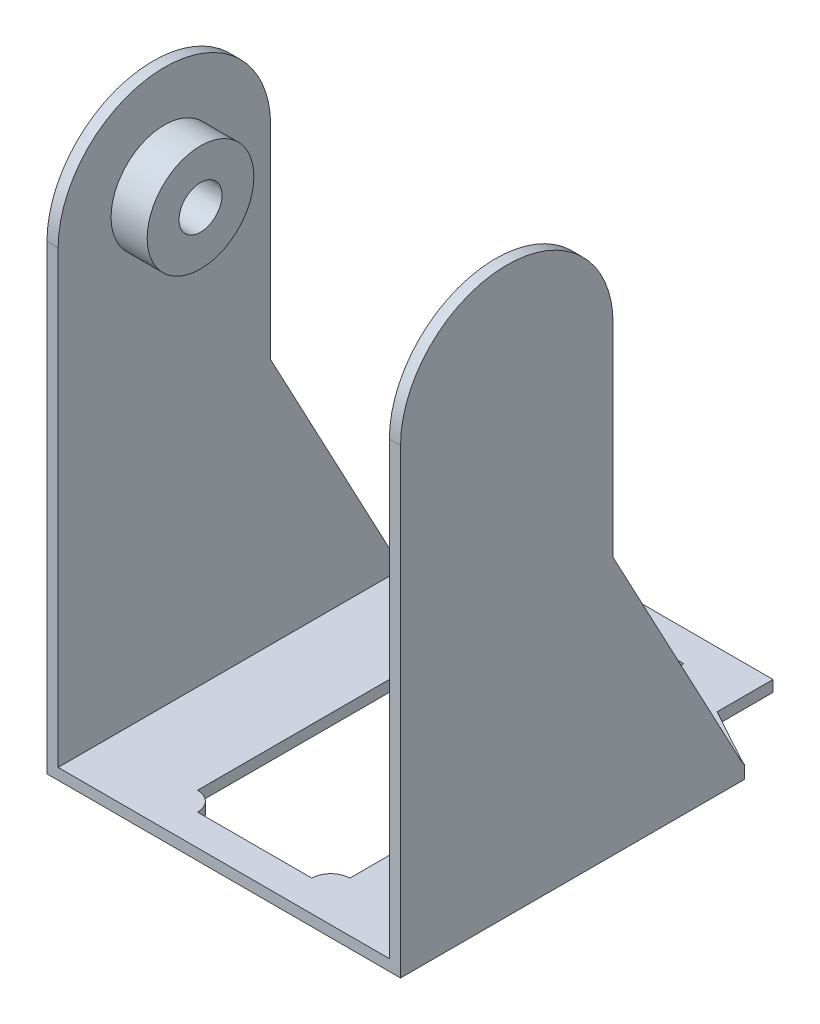
ISO-10303-21;
HEADER;
FILE_DESCRIPTION(('STEP AP214'),'2;1');
FILE_NAME('part.step','',(''),(''),'','','');
FILE_SCHEMA(('AUTOMOTIVE_DESIGN { 1 0 10303 214 1 1 1 1 }'));
ENDSEC;
DATA;
#1=APPLICATION_CONTEXT('core data for automotive mechanical design processes');
#2=APPLICATION_PROTOCOL_DEFINITION('international standard','automotive_design',2000,#1);
#3=PRODUCT_CONTEXT('',#1,'mechanical');
#4=PRODUCT('Part','Part','',(#3));
#5=PRODUCT_RELATED_PRODUCT_CATEGORY('part','',(#4));
#6=PRODUCT_DEFINITION_FORMATION('','',#4);
#7=PRODUCT_DEFINITION_CONTEXT('part definition',#1,'design');
#8=PRODUCT_DEFINITION('design','',#6,#7);
#9=PRODUCT_DEFINITION_SHAPE('','',#8);
#10=(LENGTH_UNIT() NAMED_UNIT(*) SI_UNIT(.MILLI.,.METRE.));
#11=(NAMED_UNIT(*) PLANE_ANGLE_UNIT() SI_UNIT($,.RADIAN.));
#12=(NAMED_UNIT(*) SI_UNIT($,.STERADIAN.) SOLID_ANGLE_UNIT());
#13=UNCERTAINTY_MEASURE_WITH_UNIT(LENGTH_MEASURE(1.E-05),#10,'distance_accuracy_value','');
#14=(GEOMETRIC_REPRESENTATION_CONTEXT(3) GLOBAL_UNCERTAINTY_ASSIGNED_CONTEXT((#13)) GLOBAL_UNIT_ASSIGNED_CONTEXT((#10,
#11,#12)) REPRESENTATION_CONTEXT('',''));
#15=CARTESIAN_POINT('',(0.,0.,0.));
#16=DIRECTION('',(0.,0.,1.));
#17=DIRECTION('',(1.,0.,0.));
#18=AXIS2_PLACEMENT_3D('',#15,#16,#17);
#19=CARTESIAN_POINT('',(0.,1.3,16.4));
#20=DIRECTION('',(0.,0.,-1.));
#21=DIRECTION('',(-1.,0.,0.));
#22=AXIS2_PLACEMENT_3D('',#19,#20,#21);
#23=PLANE('',#22);
#24=DIRECTION('',(1.,0.,0.));
#25=VECTOR('',#24,1.);
#26=CARTESIAN_POINT('',(0.,0.,16.4));
#27=LINE('',#26,#25);
#28=CARTESIAN_POINT('',(-6.65,0.,16.4));
#29=VERTEX_POINT('',#28);
#30=CARTESIAN_POINT('',(6.65000000000002,0.,16.4));
#31=VERTEX_POINT('',#30);
#32=EDGE_CURVE('E422',#29,#31,#27,.T.);
#33=ORIENTED_EDGE('',*,*,#32,.F.);
#34=DIRECTION('',(0.,-1.,0.));
#35=VECTOR('',#34,1.);
#36=CARTESIAN_POINT('',(-6.65,1.3,16.4));
#37=LINE('',#36,#35);
#38=CARTESIAN_POINT('',(-6.65,1.3,16.4));
#39=VERTEX_POINT('',#38);
#40=EDGE_CURVE('E474',#39,#29,#37,.T.);
#41=ORIENTED_EDGE('',*,*,#40,.F.);
#42=DIRECTION('',(1.,0.,0.));
#43=VECTOR('',#42,1.);
#44=CARTESIAN_POINT('',(0.,1.3,16.4));
#45=LINE('',#44,#43);
#46=CARTESIAN_POINT('',(6.65000000000002,1.3,16.4));
#47=VERTEX_POINT('',#46);
#48=EDGE_CURVE('E364',#39,#47,#45,.T.);
#49=ORIENTED_EDGE('',*,*,#48,.T.);
#50=DIRECTION('',(0.,-1.,0.));
#51=VECTOR('',#50,1.);
#52=CARTESIAN_POINT('',(6.65000000000002,1.3,16.4));
#53=LINE('',#52,#51);
#54=EDGE_CURVE('E453',#47,#31,#53,.T.);
#55=ORIENTED_EDGE('',*,*,#54,.T.);
#56=EDGE_LOOP('',(#33,#41,#49,#55));
#57=FACE_BOUND('',#56,.T.);
#58=ADVANCED_FACE('F45',(#57),#23,.T.);
#59=CARTESIAN_POINT('',(-8.85,1.3,16.4));
#60=DIRECTION('',(0.,-1.,0.));
#61=DIRECTION('',(0.,0.,-1.));
#62=AXIS2_PLACEMENT_3D('',#59,#60,#61);
#63=CYLINDRICAL_SURFACE('',#62,2.2);
#64=CARTESIAN_POINT('',(-8.85,0.,16.4));
#65=DIRECTION('',(0.,1.,0.));
#66=DIRECTION('',(0.,0.,1.));
#67=AXIS2_PLACEMENT_3D('',#64,#65,#66);
#68=CIRCLE('',#67,2.2);
#69=CARTESIAN_POINT('',(-8.85,0.,14.2));
#70=VERTEX_POINT('',#69);
#71=EDGE_CURVE('E426',#29,#70,#68,.T.);
#72=ORIENTED_EDGE('',*,*,#71,.T.);
#73=DIRECTION('',(0.,-1.,0.));
#74=VECTOR('',#73,1.);
#75=CARTESIAN_POINT('',(-8.85,1.3,14.2));
#76=LINE('',#75,#74);
#77=CARTESIAN_POINT('',(-8.85,1.3,14.2));
#78=VERTEX_POINT('',#77);
#79=EDGE_CURVE('E471',#78,#70,#76,.T.);
#80=ORIENTED_EDGE('',*,*,#79,.F.);
#81=CARTESIAN_POINT('',(-8.85,1.3,16.4));
#82=DIRECTION('',(0.,1.,0.));
#83=DIRECTION('',(0.,0.,1.));
#84=AXIS2_PLACEMENT_3D('',#81,#82,#83);
#85=CIRCLE('',#84,2.2);
#86=EDGE_CURVE('E368',#39,#78,#85,.T.);
#87=ORIENTED_EDGE('',*,*,#86,.F.);
#88=ORIENTED_EDGE('',*,*,#40,.T.);
#89=EDGE_LOOP('',(#72,#80,#87,#88));
#90=FACE_BOUND('',#89,.T.);
#91=ADVANCED_FACE('F561',(#90),#63,.T.);
#92=CARTESIAN_POINT('',(-8.85,1.3,0.));
#93=DIRECTION('',(1.,0.,0.));
#94=DIRECTION('',(0.,0.,-1.));
#95=AXIS2_PLACEMENT_3D('',#92,#93,#94);
#96=PLANE('',#95);
#97=DIRECTION('',(0.,0.,1.));
#98=VECTOR('',#97,1.);
#99=CARTESIAN_POINT('',(-8.85,0.,0.));
#100=LINE('',#99,#98);
#101=CARTESIAN_POINT('',(-8.85,0.,-24.6));
#102=VERTEX_POINT('',#101);
#103=EDGE_CURVE('E430',#102,#70,#100,.T.);
#104=ORIENTED_EDGE('',*,*,#103,.F.);
#105=DIRECTION('',(0.,-1.,0.));
#106=VECTOR('',#105,1.);
#107=CARTESIAN_POINT('',(-8.85,1.3,-24.6));
#108=LINE('',#107,#106);
#109=CARTESIAN_POINT('',(-8.85,1.3,-24.6));
#110=VERTEX_POINT('',#109);
#111=EDGE_CURVE('E468',#110,#102,#108,.T.);
#112=ORIENTED_EDGE('',*,*,#111,.F.);
#113=DIRECTION('',(0.,0.,1.));
#114=VECTOR('',#113,1.);
#115=CARTESIAN_POINT('',(-8.85,1.3,0.));
#116=LINE('',#115,#114);
#117=EDGE_CURVE('E371',#110,#78,#116,.T.);
#118=ORIENTED_EDGE('',*,*,#117,.T.);
#119=ORIENTED_EDGE('',*,*,#79,.T.);
#120=EDGE_LOOP('',(#104,#112,#118,#119));
#121=FACE_BOUND('',#120,.T.);
#122=ADVANCED_FACE('F567',(#121),#96,.T.);
#123=CARTESIAN_POINT('',(-8.85,1.3,-26.8));
#124=DIRECTION('',(0.,-1.,0.));
#125=DIRECTION('',(0.,0.,-1.));
#126=AXIS2_PLACEMENT_3D('',#123,#124,#125);
#127=CYLINDRICAL_SURFACE('',#126,2.2);
#128=CARTESIAN_POINT('',(-8.85,0.,-26.8));
#129=DIRECTION('',(0.,1.,0.));
#130=DIRECTION('',(0.,0.,1.));
#131=AXIS2_PLACEMENT_3D('',#128,#129,#130);
#132=CIRCLE('',#131,2.2);
#133=CARTESIAN_POINT('',(-6.65,0.,-26.8));
#134=VERTEX_POINT('',#133);
#135=EDGE_CURVE('E434',#102,#134,#132,.T.);
#136=ORIENTED_EDGE('',*,*,#135,.T.);
#137=DIRECTION('',(0.,-1.,0.));
#138=VECTOR('',#137,1.);
#139=CARTESIAN_POINT('',(-6.65,1.3,-26.8));
#140=LINE('',#139,#138);
#141=CARTESIAN_POINT('',(-6.65,1.3,-26.8));
#142=VERTEX_POINT('',#141);
#143=EDGE_CURVE('E465',#142,#134,#140,.T.);
#144=ORIENTED_EDGE('',*,*,#143,.F.);
#145=CARTESIAN_POINT('',(-8.85,1.3,-26.8));
#146=DIRECTION('',(0.,1.,0.));
#147=DIRECTION('',(0.,0.,1.));
#148=AXIS2_PLACEMENT_3D('',#145,#146,#147);
#149=CIRCLE('',#148,2.2);
#150=EDGE_CURVE('E375',#110,#142,#149,.T.);
#151=ORIENTED_EDGE('',*,*,#150,.F.);
#152=ORIENTED_EDGE('',*,*,#111,.T.);
#153=EDGE_LOOP('',(#136,#144,#151,#152));
#154=FACE_BOUND('',#153,.T.);
#155=ADVANCED_FACE('F1002',(#154),#127,.T.);
#156=CARTESIAN_POINT('',(0.,1.3,-26.8));
#157=DIRECTION('',(0.,0.,1.));
#158=DIRECTION('',(1.,0.,0.));
#159=AXIS2_PLACEMENT_3D('',#156,#157,#158);
#160=PLANE('',#159);
#161=DIRECTION('',(-1.,0.,0.));
#162=VECTOR('',#161,1.);
#163=CARTESIAN_POINT('',(0.,0.,-26.8));
#164=LINE('',#163,#162);
#165=CARTESIAN_POINT('',(6.65,0.,-26.8));
#166=VERTEX_POINT('',#165);
#167=EDGE_CURVE('E438',#166,#134,#164,.T.);
#168=ORIENTED_EDGE('',*,*,#167,.F.);
#169=DIRECTION('',(0.,-1.,0.));
#170=VECTOR('',#169,1.);
#171=CARTESIAN_POINT('',(6.65,1.3,-26.8));
#172=LINE('',#171,#170);
#173=CARTESIAN_POINT('',(6.65,1.3,-26.8));
#174=VERTEX_POINT('',#173);
#175=EDGE_CURVE('E462',#174,#166,#172,.T.);
#176=ORIENTED_EDGE('',*,*,#175,.F.);
#177=DIRECTION('',(-1.,0.,0.));
#178=VECTOR('',#177,1.);
#179=CARTESIAN_POINT('',(0.,1.3,-26.8));
#180=LINE('',#179,#178);
#181=EDGE_CURVE('E378',#174,#142,#180,.T.);
#182=ORIENTED_EDGE('',*,*,#181,.T.);
#183=ORIENTED_EDGE('',*,*,#143,.T.);
#184=EDGE_LOOP('',(#168,#176,#182,#183));
#185=FACE_BOUND('',#184,.T.);
#186=ADVANCED_FACE('F991',(#185),#160,.T.);
#187=CARTESIAN_POINT('',(8.85,1.3,-26.8));
#188=DIRECTION('',(0.,-1.,0.));
#189=DIRECTION('',(0.,0.,-1.));
#190=AXIS2_PLACEMENT_3D('',#187,#188,#189);
#191=CYLINDRICAL_SURFACE('',#190,2.2);
#192=CARTESIAN_POINT('',(8.85,0.,-26.8));
#193=DIRECTION('',(0.,1.,0.));
#194=DIRECTION('',(0.,0.,1.));
#195=AXIS2_PLACEMENT_3D('',#192,#193,#194);
#196=CIRCLE('',#195,2.2);
#197=CARTESIAN_POINT('',(8.85,0.,-24.6));
#198=VERTEX_POINT('',#197);
#199=EDGE_CURVE('E442',#198,#166,#196,.F.);
#200=ORIENTED_EDGE('',*,*,#199,.F.);
#201=DIRECTION('',(0.,-1.,0.));
#202=VECTOR('',#201,1.);
#203=CARTESIAN_POINT('',(8.85,1.3,-24.6));
#204=LINE('',#203,#202);
#205=CARTESIAN_POINT('',(8.85,1.3,-24.6));
#206=VERTEX_POINT('',#205);
#207=EDGE_CURVE('E459',#206,#198,#204,.T.);
#208=ORIENTED_EDGE('',*,*,#207,.F.);
#209=CARTESIAN_POINT('',(8.85,1.3,-26.8));
#210=DIRECTION('',(0.,1.,0.));
#211=DIRECTION('',(0.,0.,1.));
#212=AXIS2_PLACEMENT_3D('',#209,#210,#211);
#213=CIRCLE('',#212,2.2);
#214=EDGE_CURVE('E382',#206,#174,#213,.F.);
#215=ORIENTED_EDGE('',*,*,#214,.T.);
#216=ORIENTED_EDGE('',*,*,#175,.T.);
#217=EDGE_LOOP('',(#200,#208,#215,#216));
#218=FACE_BOUND('',#217,.T.);
#219=ADVANCED_FACE('F607',(#218),#191,.T.);
#220=CARTESIAN_POINT('',(8.85000000000001,1.3,0.));
#221=DIRECTION('',(1.,0.,0.));
#222=DIRECTION('',(0.,0.,-1.));
#223=AXIS2_PLACEMENT_3D('',#220,#221,#222);
#224=PLANE('',#223);
#225=DIRECTION('',(0.,0.,1.));
#226=VECTOR('',#225,1.);
#227=CARTESIAN_POINT('',(8.85000000000001,0.,0.));
#228=LINE('',#227,#226);
#229=CARTESIAN_POINT('',(8.85000000000002,0.,14.2));
#230=VERTEX_POINT('',#229);
#231=EDGE_CURVE('E446',#198,#230,#228,.T.);
#232=ORIENTED_EDGE('',*,*,#231,.T.);
#233=DIRECTION('',(0.,-1.,0.));
#234=VECTOR('',#233,1.);
#235=CARTESIAN_POINT('',(8.85000000000002,1.3,14.2));
#236=LINE('',#235,#234);
#237=CARTESIAN_POINT('',(8.85000000000002,1.3,14.2));
#238=VERTEX_POINT('',#237);
#239=EDGE_CURVE('E456',#238,#230,#236,.T.);
#240=ORIENTED_EDGE('',*,*,#239,.F.);
#241=DIRECTION('',(0.,0.,1.));
#242=VECTOR('',#241,1.);
#243=CARTESIAN_POINT('',(8.85000000000001,1.3,0.));
#244=LINE('',#243,#242);
#245=EDGE_CURVE('E386',#206,#238,#244,.T.);
#246=ORIENTED_EDGE('',*,*,#245,.F.);
#247=ORIENTED_EDGE('',*,*,#207,.T.);
#248=EDGE_LOOP('',(#232,#240,#246,#247));
#249=FACE_BOUND('',#248,.T.);
#250=ADVANCED_FACE('F603',(#249),#224,.F.);
#251=CARTESIAN_POINT('',(20.55,1.3,0.));
#252=DIRECTION('',(1.,0.,0.));
#253=DIRECTION('',(0.,0.,-1.));
#254=AXIS2_PLACEMENT_3D('',#251,#252,#253);
#255=PLANE('',#254);
#256=DIRECTION('',(0.,0.,1.));
#257=VECTOR('',#256,1.);
#258=CARTESIAN_POINT('',(20.55,0.,0.));
#259=LINE('',#258,#257);
#260=CARTESIAN_POINT('',(20.55,0.,-20.));
#261=VERTEX_POINT('',#260);
#262=CARTESIAN_POINT('',(20.55,0.,20.));
#263=VERTEX_POINT('',#262);
#264=EDGE_CURVE('E335',#261,#263,#259,.T.);
#265=ORIENTED_EDGE('',*,*,#264,.F.);
#266=DIRECTION('',(0.,-1.,0.));
#267=VECTOR('',#266,1.);
#268=CARTESIAN_POINT('',(20.55,1.3,-20.));
#269=LINE('',#268,#267);
#270=CARTESIAN_POINT('',(20.55,1.50009226069082,-20.));
#271=VERTEX_POINT('',#270);
#272=EDGE_CURVE('E61',#271,#261,#269,.T.);
#273=ORIENTED_EDGE('',*,*,#272,.F.);
#274=CARTESIAN_POINT('',(20.55,2.3,-20.6001229945547));
#275=DIRECTION('',(1.,0.,0.));
#276=DIRECTION('',(0.,0.,-1.));
#277=AXIS2_PLACEMENT_3D('',#274,#275,#276);
#278=CIRCLE('',#277,1.);
#279=CARTESIAN_POINT('',(20.55,1.82957135875238,-19.7176849550902));
#280=VERTEX_POINT('',#279);
#281=EDGE_CURVE('E634',#271,#280,#278,.F.);
#282=ORIENTED_EDGE('',*,*,#281,.T.);
#283=DIRECTION('',(0.,0.882438039464484,0.470428641247617));
#284=VECTOR('',#283,1.);
#285=CARTESIAN_POINT('',(20.55,8.59017659626766,-16.1135992361361));
#286=LINE('',#285,#284);
#287=CARTESIAN_POINT('',(20.55,30.,-4.7));
#288=VERTEX_POINT('',#287);
#289=EDGE_CURVE('E690',#280,#288,#286,.T.);
#290=ORIENTED_EDGE('',*,*,#289,.T.);
#291=DIRECTION('',(0.,1.,0.));
#292=VECTOR('',#291,1.);
#293=CARTESIAN_POINT('',(20.55,0.,-4.7));
#294=LINE('',#293,#292);
#295=CARTESIAN_POINT('',(20.55,53.6,-4.7));
#296=VERTEX_POINT('',#295);
#297=EDGE_CURVE('E247',#288,#296,#294,.T.);
#298=ORIENTED_EDGE('',*,*,#297,.T.);
#299=CARTESIAN_POINT('',(20.55,53.6,7.65));
#300=DIRECTION('',(-1.,0.,0.));
#301=DIRECTION('',(0.,0.,1.));
#302=AXIS2_PLACEMENT_3D('',#299,#300,#301);
#303=ELLIPSE('',#302,12.35,12.);
#304=CARTESIAN_POINT('',(20.55,53.6,20.));
#305=VERTEX_POINT('',#304);
#306=EDGE_CURVE('E241',#305,#296,#303,.T.);
#307=ORIENTED_EDGE('',*,*,#306,.F.);
#308=DIRECTION('',(0.,-1.,0.));
#309=VECTOR('',#308,1.);
#310=CARTESIAN_POINT('',(20.55,1.3,20.));
#311=LINE('',#310,#309);
#312=EDGE_CURVE('E393',#305,#263,#311,.T.);
#313=ORIENTED_EDGE('',*,*,#312,.T.);
#314=EDGE_LOOP('',(#265,#273,#282,#290,#298,#307,#313));
#315=FACE_BOUND('',#314,.T.);
#316=ADVANCED_FACE('F600',(#315),#255,.T.);
#317=CARTESIAN_POINT('',(13.2027659250229,1.3,-24.0358046327339));
#318=DIRECTION('',(-0.481444792985106,0.,0.876476417998527));
#319=DIRECTION('',(0.876476417998527,0.,0.481444792985106));
#320=AXIS2_PLACEMENT_3D('',#317,#318,#319);
#321=PLANE('',#320);
#322=DIRECTION('',(-0.876476417998527,0.,-0.481444792985106));
#323=VECTOR('',#322,1.);
#324=CARTESIAN_POINT('',(13.2027659250229,0.,-24.0358046327339));
#325=LINE('',#324,#323);
#326=CARTESIAN_POINT('',(13.45,0.,-23.9));
#327=VERTEX_POINT('',#326);
#328=EDGE_CURVE('E397',#261,#327,#325,.T.);
#329=ORIENTED_EDGE('',*,*,#328,.T.);
#330=DIRECTION('',(0.,-1.,0.));
#331=VECTOR('',#330,1.);
#332=CARTESIAN_POINT('',(13.45,1.3,-23.9));
#333=LINE('',#332,#331);
#334=CARTESIAN_POINT('',(13.45,1.3,-23.9));
#335=VERTEX_POINT('',#334);
#336=EDGE_CURVE('E491',#335,#327,#333,.T.);
#337=ORIENTED_EDGE('',*,*,#336,.F.);
#338=DIRECTION('',(-0.876476417998527,0.,-0.481444792985106));
#339=VECTOR('',#338,1.);
#340=CARTESIAN_POINT('',(13.2027659250229,1.3,-24.0358046327339));
#341=LINE('',#340,#339);
#342=CARTESIAN_POINT('',(19.4574683945287,1.3,-20.6001229945547));
#343=VERTEX_POINT('',#342);
#344=EDGE_CURVE('E342',#343,#335,#341,.T.);
#345=ORIENTED_EDGE('',*,*,#344,.F.);
#346=CARTESIAN_POINT('',(19.4574683945287,2.3,-20.6001229945547));
#347=DIRECTION('',(-0.481444792985106,0.,0.876476417998527));
#348=DIRECTION('',(-0.876476417998527,0.,-0.481444792985106));
#349=AXIS2_PLACEMENT_3D('',#346,#347,#348);
#350=ELLIPSE('',#349,2.07708134882858,1.);
#351=EDGE_CURVE('E630',#343,#271,#350,.T.);
#352=ORIENTED_EDGE('',*,*,#351,.T.);
#353=ORIENTED_EDGE('',*,*,#272,.T.);
#354=EDGE_LOOP('',(#329,#337,#345,#352,#353));
#355=FACE_BOUND('',#354,.T.);
#356=ADVANCED_FACE('F597',(#355),#321,.F.);
#357=CARTESIAN_POINT('',(13.45,1.3,0.));
#358=DIRECTION('',(-1.,0.,0.));
#359=DIRECTION('',(0.,0.,1.));
#360=AXIS2_PLACEMENT_3D('',#357,#358,#359);
#361=PLANE('',#360);
#362=DIRECTION('',(0.,0.,-1.));
#363=VECTOR('',#362,1.);
#364=CARTESIAN_POINT('',(13.45,0.,0.));
#365=LINE('',#364,#363);
#366=CARTESIAN_POINT('',(13.45,0.,-30.4));
#367=VERTEX_POINT('',#366);
#368=EDGE_CURVE('E400',#327,#367,#365,.T.);
#369=ORIENTED_EDGE('',*,*,#368,.T.);
#370=DIRECTION('',(0.,-1.,0.));
#371=VECTOR('',#370,1.);
#372=CARTESIAN_POINT('',(13.45,1.3,-30.4));
#373=LINE('',#372,#371);
#374=CARTESIAN_POINT('',(13.45,1.3,-30.4));
#375=VERTEX_POINT('',#374);
#376=EDGE_CURVE('E488',#375,#367,#373,.T.);
#377=ORIENTED_EDGE('',*,*,#376,.F.);
#378=DIRECTION('',(0.,0.,-1.));
#379=VECTOR('',#378,1.);
#380=CARTESIAN_POINT('',(13.45,1.3,0.));
#381=LINE('',#380,#379);
#382=EDGE_CURVE('E345',#335,#375,#381,.T.);
#383=ORIENTED_EDGE('',*,*,#382,.F.);
#384=ORIENTED_EDGE('',*,*,#336,.T.);
#385=EDGE_LOOP('',(#369,#377,#383,#384));
#386=FACE_BOUND('',#385,.T.);
#387=ADVANCED_FACE('F593',(#386),#361,.F.);
#388=CARTESIAN_POINT('',(0.,1.3,-30.4));
#389=DIRECTION('',(0.,0.,-1.));
#390=DIRECTION('',(-1.,0.,0.));
#391=AXIS2_PLACEMENT_3D('',#388,#389,#390);
#392=PLANE('',#391);
#393=DIRECTION('',(1.,0.,0.));
#394=VECTOR('',#393,1.);
#395=CARTESIAN_POINT('',(0.,0.,-30.4));
#396=LINE('',#395,#394);
#397=CARTESIAN_POINT('',(-13.45,0.,-30.4));
#398=VERTEX_POINT('',#397);
#399=EDGE_CURVE('E404',#398,#367,#396,.T.);
#400=ORIENTED_EDGE('',*,*,#399,.F.);
#401=DIRECTION('',(0.,-1.,0.));
#402=VECTOR('',#401,1.);
#403=CARTESIAN_POINT('',(-13.45,1.3,-30.4));
#404=LINE('',#403,#402);
#405=CARTESIAN_POINT('',(-13.45,1.3,-30.4));
#406=VERTEX_POINT('',#405);
#407=EDGE_CURVE('E484',#406,#398,#404,.T.);
#408=ORIENTED_EDGE('',*,*,#407,.F.);
#409=DIRECTION('',(1.,0.,0.));
#410=VECTOR('',#409,1.);
#411=CARTESIAN_POINT('',(0.,1.3,-30.4));
#412=LINE('',#411,#410);
#413=EDGE_CURVE('E349',#406,#375,#412,.T.);
#414=ORIENTED_EDGE('',*,*,#413,.T.);
#415=ORIENTED_EDGE('',*,*,#376,.T.);
#416=EDGE_LOOP('',(#400,#408,#414,#415));
#417=FACE_BOUND('',#416,.T.);
#418=ADVANCED_FACE('F589',(#417),#392,.T.);
#419=CARTESIAN_POINT('',(-13.45,1.3,0.));
#420=DIRECTION('',(-1.,0.,0.));
#421=DIRECTION('',(0.,0.,1.));
#422=AXIS2_PLACEMENT_3D('',#419,#420,#421);
#423=PLANE('',#422);
#424=DIRECTION('',(0.,0.,-1.));
#425=VECTOR('',#424,1.);
#426=CARTESIAN_POINT('',(-13.45,0.,0.));
#427=LINE('',#426,#425);
#428=CARTESIAN_POINT('',(-13.45,0.,-24.4916362338636));
#429=VERTEX_POINT('',#428);
#430=EDGE_CURVE('E408',#429,#398,#427,.T.);
#431=ORIENTED_EDGE('',*,*,#430,.F.);
#432=DIRECTION('',(0.,-1.,0.));
#433=VECTOR('',#432,1.);
#434=CARTESIAN_POINT('',(-13.45,1.3,-24.4916362338636));
#435=LINE('',#434,#433);
#436=CARTESIAN_POINT('',(-13.45,1.3,-24.4916362338636));
#437=VERTEX_POINT('',#436);
#438=EDGE_CURVE('E516',#429,#437,#435,.F.);
#439=ORIENTED_EDGE('',*,*,#438,.T.);
#440=DIRECTION('',(0.,0.,-1.));
#441=VECTOR('',#440,1.);
#442=CARTESIAN_POINT('',(-13.45,1.3,0.));
#443=LINE('',#442,#441);
#444=EDGE_CURVE('E353',#437,#406,#443,.T.);
#445=ORIENTED_EDGE('',*,*,#444,.T.);
#446=ORIENTED_EDGE('',*,*,#407,.T.);
#447=EDGE_LOOP('',(#431,#439,#445,#446));
#448=FACE_BOUND('',#447,.T.);
#449=ADVANCED_FACE('F585',(#448),#423,.T.);
#450=CARTESIAN_POINT('',(-13.2027659250229,1.3,-24.0358046327339));
#451=DIRECTION('',(-0.481444792985106,0.,-0.876476417998527));
#452=DIRECTION('',(-0.876476417998527,0.,0.481444792985106));
#453=AXIS2_PLACEMENT_3D('',#450,#451,#452);
#454=PLANE('',#453);
#455=DIRECTION('',(0.876476417998527,0.,-0.481444792985106));
#456=VECTOR('',#455,1.);
#457=CARTESIAN_POINT('',(-13.2027659250229,0.,-24.0358046327339));
#458=LINE('',#457,#456);
#459=CARTESIAN_POINT('',(-20.0314447929851,0.,-20.2848401841349));
#460=VERTEX_POINT('',#459);
#461=CARTESIAN_POINT('',(-13.9685552070149,0.,-23.6151598158651));
#462=VERTEX_POINT('',#461);
#463=EDGE_CURVE('E411',#460,#462,#458,.T.);
#464=ORIENTED_EDGE('',*,*,#463,.F.);
#465=DIRECTION('',(0.,-1.,0.));
#466=VECTOR('',#465,1.);
#467=CARTESIAN_POINT('',(-20.0314447929851,1.3,-20.2848401841349));
#468=LINE('',#467,#466);
#469=CARTESIAN_POINT('',(-20.0314447929851,1.35100223948956,-20.2848401841349));
#470=VERTEX_POINT('',#469);
#471=EDGE_CURVE('E507',#460,#470,#468,.F.);
#472=ORIENTED_EDGE('',*,*,#471,.T.);
#473=CARTESIAN_POINT('',(-19.4574683945287,2.3,-20.6001229945547));
#474=DIRECTION('',(-0.481444792985106,0.,-0.876476417998527));
#475=DIRECTION('',(-0.876476417998527,0.,0.481444792985106));
#476=AXIS2_PLACEMENT_3D('',#473,#474,#475);
#477=ELLIPSE('',#476,2.07708134882858,1.);
#478=CARTESIAN_POINT('',(-19.4574683945287,1.3,-20.6001229945547));
#479=VERTEX_POINT('',#478);
#480=EDGE_CURVE('E529',#470,#479,#477,.F.);
#481=ORIENTED_EDGE('',*,*,#480,.T.);
#482=DIRECTION('',(0.876476417998527,0.,-0.481444792985106));
#483=VECTOR('',#482,1.);
#484=CARTESIAN_POINT('',(-13.2027659250229,1.3,-24.0358046327339));
#485=LINE('',#484,#483);
#486=CARTESIAN_POINT('',(-13.9685552070149,1.3,-23.6151598158651));
#487=VERTEX_POINT('',#486);
#488=EDGE_CURVE('E356',#479,#487,#485,.T.);
#489=ORIENTED_EDGE('',*,*,#488,.T.);
#490=DIRECTION('',(0.,-1.,0.));
#491=VECTOR('',#490,1.);
#492=CARTESIAN_POINT('',(-13.9685552070149,0.,-23.6151598158651));
#493=LINE('',#492,#491);
#494=EDGE_CURVE('E503',#487,#462,#493,.T.);
#495=ORIENTED_EDGE('',*,*,#494,.T.);
#496=EDGE_LOOP('',(#464,#472,#481,#489,#495));
#497=FACE_BOUND('',#496,.T.);
#498=ADVANCED_FACE('F581',(#497),#454,.T.);
#499=CARTESIAN_POINT('',(-20.55,1.3,0.));
#500=DIRECTION('',(1.,0.,0.));
#501=DIRECTION('',(0.,0.,-1.));
#502=AXIS2_PLACEMENT_3D('',#499,#500,#501);
#503=PLANE('',#502);
#504=DIRECTION('',(0.,0.882438039464484,0.470428641247617));
#505=VECTOR('',#504,1.);
#506=CARTESIAN_POINT('',(-20.55,8.59017659626766,-16.1135992361361));
#507=LINE('',#506,#505);
#508=CARTESIAN_POINT('',(-20.55,2.40980130143038,-19.4083637661364));
#509=VERTEX_POINT('',#508);
#510=CARTESIAN_POINT('',(-20.55,30.,-4.7));
#511=VERTEX_POINT('',#510);
#512=EDGE_CURVE('E318',#509,#511,#507,.T.);
#513=ORIENTED_EDGE('',*,*,#512,.F.);
#514=DIRECTION('',(0.,-1.,0.));
#515=VECTOR('',#514,1.);
#516=CARTESIAN_POINT('',(-20.55,0.,-19.4083637661364));
#517=LINE('',#516,#515);
#518=CARTESIAN_POINT('',(-20.55,0.,-19.4083637661364));
#519=VERTEX_POINT('',#518);
#520=EDGE_CURVE('E477',#509,#519,#517,.T.);
#521=ORIENTED_EDGE('',*,*,#520,.T.);
#522=DIRECTION('',(0.,0.,1.));
#523=VECTOR('',#522,1.);
#524=CARTESIAN_POINT('',(-20.55,0.,0.));
#525=LINE('',#524,#523);
#526=CARTESIAN_POINT('',(-20.55,0.,20.));
#527=VERTEX_POINT('',#526);
#528=EDGE_CURVE('E415',#519,#527,#525,.T.);
#529=ORIENTED_EDGE('',*,*,#528,.T.);
#530=DIRECTION('',(0.,-1.,0.));
#531=VECTOR('',#530,1.);
#532=CARTESIAN_POINT('',(-20.55,1.3,20.));
#533=LINE('',#532,#531);
#534=CARTESIAN_POINT('',(-20.55,53.6,20.));
#535=VERTEX_POINT('',#534);
#536=EDGE_CURVE('E480',#535,#527,#533,.T.);
#537=ORIENTED_EDGE('',*,*,#536,.F.);
#538=CARTESIAN_POINT('',(-20.55,53.6,7.65));
#539=DIRECTION('',(-1.,0.,0.));
#540=DIRECTION('',(0.,0.,1.));
#541=AXIS2_PLACEMENT_3D('',#538,#539,#540);
#542=ELLIPSE('',#541,12.35,12.);
#543=CARTESIAN_POINT('',(-20.55,53.6,-4.7));
#544=VERTEX_POINT('',#543);
#545=EDGE_CURVE('E321',#535,#544,#542,.T.);
#546=ORIENTED_EDGE('',*,*,#545,.T.);
#547=DIRECTION('',(0.,1.,0.));
#548=VECTOR('',#547,1.);
#549=CARTESIAN_POINT('',(-20.55,0.,-4.7));
#550=LINE('',#549,#548);
#551=EDGE_CURVE('E326',#511,#544,#550,.T.);
#552=ORIENTED_EDGE('',*,*,#551,.F.);
#553=EDGE_LOOP('',(#513,#521,#529,#537,#546,#552));
#554=FACE_BOUND('',#553,.T.);
#555=ADVANCED_FACE('F577',(#554),#503,.F.);
#556=CARTESIAN_POINT('',(0.,1.3,20.));
#557=DIRECTION('',(0.,0.,-1.));
#558=DIRECTION('',(-1.,0.,0.));
#559=AXIS2_PLACEMENT_3D('',#556,#557,#558);
#560=PLANE('',#559);
#561=DIRECTION('',(1.,0.,0.));
#562=VECTOR('',#561,1.);
#563=CARTESIAN_POINT('',(0.,0.,20.));
#564=LINE('',#563,#562);
#565=EDGE_CURVE('E418',#527,#263,#564,.T.);
#566=ORIENTED_EDGE('',*,*,#565,.T.);
#567=ORIENTED_EDGE('',*,*,#312,.F.);
#568=DIRECTION('',(1.,0.,0.));
#569=VECTOR('',#568,1.);
#570=CARTESIAN_POINT('',(19.25,53.6,20.));
#571=LINE('',#570,#569);
#572=CARTESIAN_POINT('',(19.25,53.6,20.));
#573=VERTEX_POINT('',#572);
#574=EDGE_CURVE('E676',#573,#305,#571,.T.);
#575=ORIENTED_EDGE('',*,*,#574,.F.);
#576=DIRECTION('',(0.,1.,0.));
#577=VECTOR('',#576,1.);
#578=CARTESIAN_POINT('',(19.25,0.,20.));
#579=LINE('',#578,#577);
#580=CARTESIAN_POINT('',(19.25,1.3,20.));
#581=VERTEX_POINT('',#580);
#582=EDGE_CURVE('E259',#581,#573,#579,.T.);
#583=ORIENTED_EDGE('',*,*,#582,.F.);
#584=DIRECTION('',(1.,0.,0.));
#585=VECTOR('',#584,1.);
#586=CARTESIAN_POINT('',(0.,1.3,20.));
#587=LINE('',#586,#585);
#588=CARTESIAN_POINT('',(-19.25,1.3,20.));
#589=VERTEX_POINT('',#588);
#590=EDGE_CURVE('E360',#589,#581,#587,.T.);
#591=ORIENTED_EDGE('',*,*,#590,.F.);
#592=DIRECTION('',(0.,1.,0.));
#593=VECTOR('',#592,1.);
#594=CARTESIAN_POINT('',(-19.25,0.,20.));
#595=LINE('',#594,#593);
#596=CARTESIAN_POINT('',(-19.25,53.6,20.));
#597=VERTEX_POINT('',#596);
#598=EDGE_CURVE('E313',#589,#597,#595,.T.);
#599=ORIENTED_EDGE('',*,*,#598,.T.);
#600=DIRECTION('',(-1.,0.,0.));
#601=VECTOR('',#600,1.);
#602=CARTESIAN_POINT('',(-19.25,53.6,20.));
#603=LINE('',#602,#601);
#604=EDGE_CURVE('E317',#597,#535,#603,.T.);
#605=ORIENTED_EDGE('',*,*,#604,.T.);
#606=ORIENTED_EDGE('',*,*,#536,.T.);
#607=EDGE_LOOP('',(#566,#567,#575,#583,#591,#599,#605,#606));
#608=FACE_BOUND('',#607,.T.);
#609=ADVANCED_FACE('F573',(#608),#560,.F.);
#610=CARTESIAN_POINT('',(8.85000000000002,1.3,16.4));
#611=DIRECTION('',(0.,-1.,0.));
#612=DIRECTION('',(0.,0.,-1.));
#613=AXIS2_PLACEMENT_3D('',#610,#611,#612);
#614=CYLINDRICAL_SURFACE('',#613,2.2);
#615=CARTESIAN_POINT('',(8.85000000000002,0.,16.4));
#616=DIRECTION('',(0.,1.,0.));
#617=DIRECTION('',(0.,0.,1.));
#618=AXIS2_PLACEMENT_3D('',#615,#616,#617);
#619=CIRCLE('',#618,2.2);
#620=EDGE_CURVE('E346',#31,#230,#619,.F.);
#621=ORIENTED_EDGE('',*,*,#620,.F.);
#622=ORIENTED_EDGE('',*,*,#54,.F.);
#623=CARTESIAN_POINT('',(8.85000000000002,1.3,16.4));
#624=DIRECTION('',(0.,1.,0.));
#625=DIRECTION('',(0.,0.,1.));
#626=AXIS2_PLACEMENT_3D('',#623,#624,#625);
#627=CIRCLE('',#626,2.2);
#628=EDGE_CURVE('E389',#47,#238,#627,.F.);
#629=ORIENTED_EDGE('',*,*,#628,.T.);
#630=ORIENTED_EDGE('',*,*,#239,.T.);
#631=EDGE_LOOP('',(#621,#622,#629,#630));
#632=FACE_BOUND('',#631,.T.);
#633=ADVANCED_FACE('F576',(#632),#614,.T.);
#634=CARTESIAN_POINT('',(0.,1.3,0.));
#635=DIRECTION('',(0.,1.,0.));
#636=DIRECTION('',(0.,0.,1.));
#637=AXIS2_PLACEMENT_3D('',#634,#635,#636);
#638=PLANE('',#637);
#639=DIRECTION('',(0.,0.,-1.));
#640=VECTOR('',#639,1.);
#641=CARTESIAN_POINT('',(19.25,1.3,0.));
#642=LINE('',#641,#640);
#643=CARTESIAN_POINT('',(19.25,1.3,-20.6001229945547));
#644=VERTEX_POINT('',#643);
#645=EDGE_CURVE('E250',#581,#644,#642,.T.);
#646=ORIENTED_EDGE('',*,*,#645,.T.);
#647=DIRECTION('',(1.,0.,0.));
#648=VECTOR('',#647,1.);
#649=CARTESIAN_POINT('',(20.55,1.3,-20.6001229945547));
#650=LINE('',#649,#648);
#651=EDGE_CURVE('E629',#644,#343,#650,.T.);
#652=ORIENTED_EDGE('',*,*,#651,.T.);
#653=ORIENTED_EDGE('',*,*,#344,.T.);
#654=ORIENTED_EDGE('',*,*,#382,.T.);
#655=ORIENTED_EDGE('',*,*,#413,.F.);
#656=ORIENTED_EDGE('',*,*,#444,.F.);
#657=CARTESIAN_POINT('',(-14.45,1.3,-24.4916362338636));
#658=DIRECTION('',(0.,1.,0.));
#659=DIRECTION('',(0.,0.,1.));
#660=AXIS2_PLACEMENT_3D('',#657,#658,#659);
#661=CIRCLE('',#660,1.);
#662=EDGE_CURVE('E526',#437,#487,#661,.F.);
#663=ORIENTED_EDGE('',*,*,#662,.T.);
#664=ORIENTED_EDGE('',*,*,#488,.F.);
#665=DIRECTION('',(-1.,0.,0.));
#666=VECTOR('',#665,1.);
#667=CARTESIAN_POINT('',(0.,1.3,-20.6001229945547));
#668=LINE('',#667,#666);
#669=CARTESIAN_POINT('',(-19.25,1.3,-20.6001229945547));
#670=VERTEX_POINT('',#669);
#671=EDGE_CURVE('E519',#479,#670,#668,.F.);
#672=ORIENTED_EDGE('',*,*,#671,.T.);
#673=DIRECTION('',(0.,0.,-1.));
#674=VECTOR('',#673,1.);
#675=CARTESIAN_POINT('',(-19.25,1.3,0.));
#676=LINE('',#675,#674);
#677=EDGE_CURVE('E648',#589,#670,#676,.T.);
#678=ORIENTED_EDGE('',*,*,#677,.F.);
#679=ORIENTED_EDGE('',*,*,#590,.T.);
#680=EDGE_LOOP('',(#646,#652,#653,#654,#655,#656,#663,#664,#672,#678,#679));
#681=FACE_BOUND('',#680,.T.);
#682=ORIENTED_EDGE('',*,*,#48,.F.);
#683=ORIENTED_EDGE('',*,*,#86,.T.);
#684=ORIENTED_EDGE('',*,*,#117,.F.);
#685=ORIENTED_EDGE('',*,*,#150,.T.);
#686=ORIENTED_EDGE('',*,*,#181,.F.);
#687=ORIENTED_EDGE('',*,*,#214,.F.);
#688=ORIENTED_EDGE('',*,*,#245,.T.);
#689=ORIENTED_EDGE('',*,*,#628,.F.);
#690=EDGE_LOOP('',(#682,#683,#684,#685,#686,#687,#688,#689));
#691=FACE_BOUND('',#690,.T.);
#692=ADVANCED_FACE('F624',(#681,#691),#638,.T.);
#693=CARTESIAN_POINT('',(0.,0.,0.));
#694=DIRECTION('',(0.,1.,0.));
#695=DIRECTION('',(0.,0.,1.));
#696=AXIS2_PLACEMENT_3D('',#693,#694,#695);
#697=PLANE('',#696);
#698=ORIENTED_EDGE('',*,*,#528,.F.);
#699=CARTESIAN_POINT('',(-19.55,0.,-19.4083637661364));
#700=DIRECTION('',(0.,1.,0.));
#701=DIRECTION('',(0.,0.,1.));
#702=AXIS2_PLACEMENT_3D('',#699,#700,#701);
#703=CIRCLE('',#702,1.);
#704=EDGE_CURVE('E500',#519,#460,#703,.F.);
#705=ORIENTED_EDGE('',*,*,#704,.T.);
#706=ORIENTED_EDGE('',*,*,#463,.T.);
#707=CARTESIAN_POINT('',(-14.45,0.,-24.4916362338636));
#708=DIRECTION('',(0.,1.,0.));
#709=DIRECTION('',(0.,0.,1.));
#710=AXIS2_PLACEMENT_3D('',#707,#708,#709);
#711=CIRCLE('',#710,1.);
#712=EDGE_CURVE('E523',#462,#429,#711,.T.);
#713=ORIENTED_EDGE('',*,*,#712,.T.);
#714=ORIENTED_EDGE('',*,*,#430,.T.);
#715=ORIENTED_EDGE('',*,*,#399,.T.);
#716=ORIENTED_EDGE('',*,*,#368,.F.);
#717=ORIENTED_EDGE('',*,*,#328,.F.);
#718=ORIENTED_EDGE('',*,*,#264,.T.);
#719=ORIENTED_EDGE('',*,*,#565,.F.);
#720=EDGE_LOOP('',(#698,#705,#706,#713,#714,#715,#716,#717,#718,#719));
#721=FACE_BOUND('',#720,.T.);
#722=ORIENTED_EDGE('',*,*,#32,.T.);
#723=ORIENTED_EDGE('',*,*,#620,.T.);
#724=ORIENTED_EDGE('',*,*,#231,.F.);
#725=ORIENTED_EDGE('',*,*,#199,.T.);
#726=ORIENTED_EDGE('',*,*,#167,.T.);
#727=ORIENTED_EDGE('',*,*,#135,.F.);
#728=ORIENTED_EDGE('',*,*,#103,.T.);
#729=ORIENTED_EDGE('',*,*,#71,.F.);
#730=EDGE_LOOP('',(#722,#723,#724,#725,#726,#727,#728,#729));
#731=FACE_BOUND('',#730,.T.);
#732=ADVANCED_FACE('F615',(#721,#731),#697,.F.);
#733=CARTESIAN_POINT('',(-19.25,8.59017659626766,-16.1135992361361));
#734=DIRECTION('',(0.,-0.470428641247617,0.882438039464483));
#735=DIRECTION('',(0.,-0.882438039464483,-0.470428641247617));
#736=AXIS2_PLACEMENT_3D('',#733,#734,#735);
#737=PLANE('',#736);
#738=DIRECTION('',(-1.,0.,0.));
#739=VECTOR('',#738,1.);
#740=CARTESIAN_POINT('',(-19.25,1.82957135875238,-19.7176849550902));
#741=LINE('',#740,#739);
#742=CARTESIAN_POINT('',(-19.25,1.82957135875238,-19.7176849550902));
#743=VERTEX_POINT('',#742);
#744=CARTESIAN_POINT('',(-20.5009576236953,1.82957135875238,-19.7176849550902));
#745=VERTEX_POINT('',#744);
#746=EDGE_CURVE('E510',#743,#745,#741,.T.);
#747=ORIENTED_EDGE('',*,*,#746,.T.);
#748=CARTESIAN_POINT('',(-19.55,2.40980130143038,-19.4083637661364));
#749=DIRECTION('',(0.,-0.470428641247617,0.882438039464483));
#750=DIRECTION('',(0.,0.882438039464483,0.470428641247617));
#751=AXIS2_PLACEMENT_3D('',#748,#749,#750);
#752=ELLIPSE('',#751,2.1257209113542,1.);
#753=EDGE_CURVE('E513',#745,#509,#752,.F.);
#754=ORIENTED_EDGE('',*,*,#753,.T.);
#755=ORIENTED_EDGE('',*,*,#512,.T.);
#756=DIRECTION('',(-1.,0.,0.));
#757=VECTOR('',#756,1.);
#758=CARTESIAN_POINT('',(-19.25,30.,-4.7));
#759=LINE('',#758,#757);
#760=CARTESIAN_POINT('',(-19.25,30.,-4.7));
#761=VERTEX_POINT('',#760);
#762=EDGE_CURVE('E331',#761,#511,#759,.T.);
#763=ORIENTED_EDGE('',*,*,#762,.F.);
#764=DIRECTION('',(0.,0.882438039464484,0.470428641247617));
#765=VECTOR('',#764,1.);
#766=CARTESIAN_POINT('',(-19.25,8.59017659626766,-16.1135992361361));
#767=LINE('',#766,#765);
#768=EDGE_CURVE('E330',#743,#761,#767,.T.);
#769=ORIENTED_EDGE('',*,*,#768,.F.);
#770=EDGE_LOOP('',(#747,#754,#755,#763,#769));
#771=FACE_BOUND('',#770,.T.);
#772=ADVANCED_FACE('F299',(#771),#737,.F.);
#773=CARTESIAN_POINT('',(-19.25,0.,-4.7));
#774=DIRECTION('',(0.,0.,1.));
#775=DIRECTION('',(1.,0.,0.));
#776=AXIS2_PLACEMENT_3D('',#773,#774,#775);
#777=PLANE('',#776);
#778=ORIENTED_EDGE('',*,*,#551,.T.);
#779=DIRECTION('',(-1.,0.,0.));
#780=VECTOR('',#779,1.);
#781=CARTESIAN_POINT('',(-19.25,53.6,-4.7));
#782=LINE('',#781,#780);
#783=CARTESIAN_POINT('',(-19.25,53.6,-4.7));
#784=VERTEX_POINT('',#783);
#785=EDGE_CURVE('E336',#784,#544,#782,.T.);
#786=ORIENTED_EDGE('',*,*,#785,.F.);
#787=DIRECTION('',(0.,1.,0.));
#788=VECTOR('',#787,1.);
#789=CARTESIAN_POINT('',(-19.25,0.,-4.7));
#790=LINE('',#789,#788);
#791=EDGE_CURVE('E312',#761,#784,#790,.T.);
#792=ORIENTED_EDGE('',*,*,#791,.F.);
#793=ORIENTED_EDGE('',*,*,#762,.T.);
#794=EDGE_LOOP('',(#778,#786,#792,#793));
#795=FACE_BOUND('',#794,.T.);
#796=ADVANCED_FACE('F296',(#795),#777,.F.);
#797=CARTESIAN_POINT('',(-19.25,53.6,7.65));
#798=DIRECTION('',(-1.,0.,0.));
#799=DIRECTION('',(0.,0.,1.));
#800=AXIS2_PLACEMENT_3D('',#797,#798,#799);
#801=ELLIPSE('',#800,12.35,12.);
#802=DIRECTION('',(-1.,0.,0.));
#803=VECTOR('',#802,1.);
#804=SURFACE_OF_LINEAR_EXTRUSION('',#801,#803);
#805=ORIENTED_EDGE('',*,*,#545,.F.);
#806=ORIENTED_EDGE('',*,*,#604,.F.);
#807=EDGE_CURVE('E306',#597,#784,#801,.T.);
#808=ORIENTED_EDGE('',*,*,#807,.T.);
#809=ORIENTED_EDGE('',*,*,#785,.T.);
#810=EDGE_LOOP('',(#805,#806,#808,#809));
#811=FACE_BOUND('',#810,.T.);
#812=ADVANCED_FACE('F294',(#811),#804,.T.);
#813=CARTESIAN_POINT('',(-19.25,0.,0.));
#814=DIRECTION('',(-1.,0.,0.));
#815=DIRECTION('',(0.,0.,1.));
#816=AXIS2_PLACEMENT_3D('',#813,#814,#815);
#817=PLANE('',#816);
#818=CARTESIAN_POINT('',(-19.25,53.6,7.65));
#819=DIRECTION('',(-1.,0.,0.));
#820=DIRECTION('',(0.,0.,1.));
#821=AXIS2_PLACEMENT_3D('',#818,#819,#820);
#822=CIRCLE('',#821,6.2);
#823=CARTESIAN_POINT('',(-19.25,53.6,13.85));
#824=VERTEX_POINT('',#823);
#825=EDGE_CURVE('E535',#824,#824,#822,.F.);
#826=ORIENTED_EDGE('',*,*,#825,.F.);
#827=EDGE_LOOP('',(#826));
#828=FACE_BOUND('',#827,.T.);
#829=ORIENTED_EDGE('',*,*,#677,.T.);
#830=CARTESIAN_POINT('',(-19.25,2.3,-20.6001229945547));
#831=DIRECTION('',(-1.,0.,0.));
#832=DIRECTION('',(0.,0.,1.));
#833=AXIS2_PLACEMENT_3D('',#830,#831,#832);
#834=CIRCLE('',#833,1.);
#835=EDGE_CURVE('E532',#670,#743,#834,.T.);
#836=ORIENTED_EDGE('',*,*,#835,.T.);
#837=ORIENTED_EDGE('',*,*,#768,.T.);
#838=ORIENTED_EDGE('',*,*,#791,.T.);
#839=ORIENTED_EDGE('',*,*,#807,.F.);
#840=ORIENTED_EDGE('',*,*,#598,.F.);
#841=EDGE_LOOP('',(#829,#836,#837,#838,#839,#840));
#842=FACE_BOUND('',#841,.T.);
#843=ADVANCED_FACE('F290',(#828,#842),#817,.F.);
#844=CARTESIAN_POINT('',(-19.25,2.3,-20.6001229945547));
#845=DIRECTION('',(-1.,0.,0.));
#846=DIRECTION('',(0.,0.,1.));
#847=AXIS2_PLACEMENT_3D('',#844,#845,#846);
#848=CYLINDRICAL_SURFACE('',#847,1.);
#849=ORIENTED_EDGE('',*,*,#671,.F.);
#850=ORIENTED_EDGE('',*,*,#480,.F.);
#851=CARTESIAN_POINT('',(-20.0314447929851,1.35100223948956,-20.2848401841349));
#852=CARTESIAN_POINT('',(-20.0514236109153,1.35465017036254,-20.2738677117985));
#853=CARTESIAN_POINT('',(-20.0709597609471,1.35872070279305,-20.2622445506414));
#854=CARTESIAN_POINT('',(-20.1090451775039,1.36785149226144,-20.2378098462745));
#855=CARTESIAN_POINT('',(-20.1275939523863,1.37291223659754,-20.2249977195955));
#856=CARTESIAN_POINT('',(-20.1815734426526,1.38978952034748,-20.1849680322125));
#857=CARTESIAN_POINT('',(-20.215342140434,1.40330191233566,-20.1561544911942));
#858=CARTESIAN_POINT('',(-20.2775935556411,1.43583278758114,-20.0957490568069));
#859=CARTESIAN_POINT('',(-20.3060539704954,1.45487367918364,-20.0641462280395));
#860=CARTESIAN_POINT('',(-20.3569767376094,1.49889424401826,-20.0003533224113));
#861=CARTESIAN_POINT('',(-20.3794501194127,1.52386283419856,-19.9681644437699));
#862=CARTESIAN_POINT('',(-20.4174801791052,1.57802421687424,-19.9070673045166));
#863=CARTESIAN_POINT('',(-20.4333517020869,1.60690535332808,-19.8780761321314));
#864=CARTESIAN_POINT('',(-20.460504178898,1.66927276446991,-19.8230048819392));
#865=CARTESIAN_POINT('',(-20.4717826585978,1.70276150817366,-19.7969263785708));
#866=CARTESIAN_POINT('',(-20.4850825454305,1.75276359220163,-19.762955555427));
#867=CARTESIAN_POINT('',(-20.4886599179443,1.76774886353644,-19.753347921059));
#868=CARTESIAN_POINT('',(-20.4952270944584,1.79825918836379,-19.7349224085944));
#869=CARTESIAN_POINT('',(-20.4982186111028,1.81378250749549,-19.7261022708067));
#870=CARTESIAN_POINT('',(-20.5009576236953,1.82957135875238,-19.7176849550902));
#871=B_SPLINE_CURVE_WITH_KNOTS('',3,(#851,#852,#853,#854,#855,#856,#857,#858,#859,#860,#861,
#862,#863,#864,#865,#866,#867,#868,#869,#870),.UNSPECIFIED.,.F.,.F.,(4,2,2,2,2,2,2,2,2,4),(0.,
0.0692174195317458,0.13846898806239,0.276955620924119,0.416011602309076,0.554809609586636,
0.685898310528116,0.817057531769788,0.871500454509662,0.925781766254854),.UNSPECIFIED.);
#872=EDGE_CURVE('E322',#745,#470,#871,.F.);
#873=ORIENTED_EDGE('',*,*,#872,.F.);
#874=ORIENTED_EDGE('',*,*,#746,.F.);
#875=ORIENTED_EDGE('',*,*,#835,.F.);
#876=EDGE_LOOP('',(#849,#850,#873,#874,#875));
#877=FACE_BOUND('',#876,.T.);
#878=ADVANCED_FACE('F293',(#877),#848,.F.);
#879=CARTESIAN_POINT('',(-19.55,1.3,-19.4083637661364));
#880=DIRECTION('',(0.,1.,0.));
#881=DIRECTION('',(0.,0.,1.));
#882=AXIS2_PLACEMENT_3D('',#879,#880,#881);
#883=CYLINDRICAL_SURFACE('',#882,1.);
#884=ORIENTED_EDGE('',*,*,#872,.T.);
#885=ORIENTED_EDGE('',*,*,#471,.F.);
#886=ORIENTED_EDGE('',*,*,#704,.F.);
#887=ORIENTED_EDGE('',*,*,#520,.F.);
#888=ORIENTED_EDGE('',*,*,#753,.F.);
#889=EDGE_LOOP('',(#884,#885,#886,#887,#888));
#890=FACE_BOUND('',#889,.T.);
#891=ADVANCED_FACE('F547',(#890),#883,.T.);
#892=CARTESIAN_POINT('',(-14.45,1.3,-24.4916362338636));
#893=DIRECTION('',(0.,1.,0.));
#894=DIRECTION('',(0.,0.,1.));
#895=AXIS2_PLACEMENT_3D('',#892,#893,#894);
#896=CYLINDRICAL_SURFACE('',#895,1.);
#897=ORIENTED_EDGE('',*,*,#662,.F.);
#898=ORIENTED_EDGE('',*,*,#438,.F.);
#899=ORIENTED_EDGE('',*,*,#712,.F.);
#900=ORIENTED_EDGE('',*,*,#494,.F.);
#901=EDGE_LOOP('',(#897,#898,#899,#900));
#902=FACE_BOUND('',#901,.T.);
#903=ADVANCED_FACE('F285',(#902),#896,.F.);
#904=CARTESIAN_POINT('',(-15.05,53.6,7.65));
#905=DIRECTION('',(1.,0.,0.));
#906=DIRECTION('',(0.,0.,-1.));
#907=AXIS2_PLACEMENT_3D('',#904,#905,#906);
#908=PLANE('',#907);
#909=CARTESIAN_POINT('',(-15.05,53.6,7.65));
#910=DIRECTION('',(1.,0.,0.));
#911=DIRECTION('',(0.,0.,-1.));
#912=AXIS2_PLACEMENT_3D('',#909,#910,#911);
#913=CIRCLE('',#912,6.2);
#914=CARTESIAN_POINT('',(-15.05,53.6,1.45));
#915=VERTEX_POINT('',#914);
#916=EDGE_CURVE('E545',#915,#915,#913,.T.);
#917=ORIENTED_EDGE('',*,*,#916,.T.);
#918=EDGE_LOOP('',(#917));
#919=FACE_BOUND('',#918,.T.);
#920=CARTESIAN_POINT('',(-15.05,53.6,7.65));
#921=DIRECTION('',(1.,0.,0.));
#922=DIRECTION('',(0.,0.,-1.));
#923=AXIS2_PLACEMENT_3D('',#920,#921,#922);
#924=CIRCLE('',#923,2.5);
#925=CARTESIAN_POINT('',(-15.05,53.6,5.15));
#926=VERTEX_POINT('',#925);
#927=EDGE_CURVE('E671',#926,#926,#924,.T.);
#928=ORIENTED_EDGE('',*,*,#927,.F.);
#929=EDGE_LOOP('',(#928));
#930=FACE_BOUND('',#929,.T.);
#931=ADVANCED_FACE('F282',(#919,#930),#908,.T.);
#932=CARTESIAN_POINT('',(-15.05,53.6,7.65));
#933=DIRECTION('',(-1.,0.,0.));
#934=DIRECTION('',(0.,0.,1.));
#935=AXIS2_PLACEMENT_3D('',#932,#933,#934);
#936=CYLINDRICAL_SURFACE('',#935,6.2);
#937=ORIENTED_EDGE('',*,*,#916,.F.);
#938=EDGE_LOOP('',(#937));
#939=FACE_BOUND('',#938,.T.);
#940=ORIENTED_EDGE('',*,*,#825,.T.);
#941=EDGE_LOOP('',(#940));
#942=FACE_BOUND('',#941,.T.);
#943=ADVANCED_FACE('F280',(#939,#942),#936,.T.);
#944=CARTESIAN_POINT('',(-15.05,53.6,7.65));
#945=DIRECTION('',(-1.,0.,0.));
#946=DIRECTION('',(0.,0.,1.));
#947=AXIS2_PLACEMENT_3D('',#944,#945,#946);
#948=CYLINDRICAL_SURFACE('',#947,2.5);
#949=ORIENTED_EDGE('',*,*,#927,.T.);
#950=EDGE_LOOP('',(#949));
#951=FACE_BOUND('',#950,.T.);
#952=CARTESIAN_POINT('',(-19.25,53.6,7.65));
#953=DIRECTION('',(1.,0.,0.));
#954=DIRECTION('',(0.,0.,-1.));
#955=AXIS2_PLACEMENT_3D('',#952,#953,#954);
#956=CIRCLE('',#955,2.5);
#957=CARTESIAN_POINT('',(-19.25,53.6,5.15));
#958=VERTEX_POINT('',#957);
#959=EDGE_CURVE('E672',#958,#958,#956,.T.);
#960=ORIENTED_EDGE('',*,*,#959,.F.);
#961=EDGE_LOOP('',(#960));
#962=FACE_BOUND('',#961,.T.);
#963=ADVANCED_FACE('F277',(#951,#962),#948,.F.);
#964=ORIENTED_EDGE('',*,*,#959,.T.);
#965=EDGE_LOOP('',(#964));
#966=FACE_BOUND('',#965,.T.);
#967=ADVANCED_FACE('F276',(#966),#817,.F.);
#968=CARTESIAN_POINT('',(19.25,8.59017659626766,-16.1135992361361));
#969=DIRECTION('',(0.,0.470428641247617,-0.882438039464483));
#970=DIRECTION('',(0.,0.882438039464483,0.470428641247617));
#971=AXIS2_PLACEMENT_3D('',#968,#969,#970);
#972=PLANE('',#971);
#973=ORIENTED_EDGE('',*,*,#289,.F.);
#974=DIRECTION('',(1.,0.,0.));
#975=VECTOR('',#974,1.);
#976=CARTESIAN_POINT('',(19.25,1.82957135875238,-19.7176849550902));
#977=LINE('',#976,#975);
#978=CARTESIAN_POINT('',(19.25,1.82957135875238,-19.7176849550902));
#979=VERTEX_POINT('',#978);
#980=EDGE_CURVE('E69',#280,#979,#977,.F.);
#981=ORIENTED_EDGE('',*,*,#980,.T.);
#982=DIRECTION('',(0.,0.882438039464484,0.470428641247617));
#983=VECTOR('',#982,1.);
#984=CARTESIAN_POINT('',(19.25,8.59017659626766,-16.1135992361361));
#985=LINE('',#984,#983);
#986=CARTESIAN_POINT('',(19.25,30.,-4.7));
#987=VERTEX_POINT('',#986);
#988=EDGE_CURVE('E230',#979,#987,#985,.T.);
#989=ORIENTED_EDGE('',*,*,#988,.T.);
#990=DIRECTION('',(1.,0.,0.));
#991=VECTOR('',#990,1.);
#992=CARTESIAN_POINT('',(19.25,30.,-4.7));
#993=LINE('',#992,#991);
#994=EDGE_CURVE('E233',#987,#288,#993,.T.);
#995=ORIENTED_EDGE('',*,*,#994,.T.);
#996=EDGE_LOOP('',(#973,#981,#989,#995));
#997=FACE_BOUND('',#996,.T.);
#998=ADVANCED_FACE('F232',(#997),#972,.T.);
#999=CARTESIAN_POINT('',(19.25,53.6,7.65));
#1000=DIRECTION('',(-1.,0.,0.));
#1001=DIRECTION('',(0.,0.,1.));
#1002=AXIS2_PLACEMENT_3D('',#999,#1000,#1001);
#1003=ELLIPSE('',#1002,12.35,12.);
#1004=DIRECTION('',(1.,0.,0.));
#1005=VECTOR('',#1004,1.);
#1006=SURFACE_OF_LINEAR_EXTRUSION('',#1003,#1005);
#1007=ORIENTED_EDGE('',*,*,#306,.T.);
#1008=DIRECTION('',(1.,0.,0.));
#1009=VECTOR('',#1008,1.);
#1010=CARTESIAN_POINT('',(19.25,53.6,-4.7));
#1011=LINE('',#1010,#1009);
#1012=CARTESIAN_POINT('',(19.25,53.6,-4.7));
#1013=VERTEX_POINT('',#1012);
#1014=EDGE_CURVE('E249',#1013,#296,#1011,.T.);
#1015=ORIENTED_EDGE('',*,*,#1014,.F.);
#1016=EDGE_CURVE('E254',#573,#1013,#1003,.T.);
#1017=ORIENTED_EDGE('',*,*,#1016,.F.);
#1018=ORIENTED_EDGE('',*,*,#574,.T.);
#1019=EDGE_LOOP('',(#1007,#1015,#1017,#1018));
#1020=FACE_BOUND('',#1019,.T.);
#1021=ADVANCED_FACE('F266',(#1020),#1006,.F.);
#1022=CARTESIAN_POINT('',(19.25,0.,-4.7));
#1023=DIRECTION('',(0.,0.,-1.));
#1024=DIRECTION('',(-1.,0.,0.));
#1025=AXIS2_PLACEMENT_3D('',#1022,#1023,#1024);
#1026=PLANE('',#1025);
#1027=ORIENTED_EDGE('',*,*,#297,.F.);
#1028=ORIENTED_EDGE('',*,*,#994,.F.);
#1029=DIRECTION('',(0.,1.,0.));
#1030=VECTOR('',#1029,1.);
#1031=CARTESIAN_POINT('',(19.25,0.,-4.7));
#1032=LINE('',#1031,#1030);
#1033=EDGE_CURVE('E240',#987,#1013,#1032,.T.);
#1034=ORIENTED_EDGE('',*,*,#1033,.T.);
#1035=ORIENTED_EDGE('',*,*,#1014,.T.);
#1036=EDGE_LOOP('',(#1027,#1028,#1034,#1035));
#1037=FACE_BOUND('',#1036,.T.);
#1038=ADVANCED_FACE('F245',(#1037),#1026,.T.);
#1039=CARTESIAN_POINT('',(19.25,0.,0.));
#1040=DIRECTION('',(1.,0.,0.));
#1041=DIRECTION('',(0.,0.,1.));
#1042=AXIS2_PLACEMENT_3D('',#1039,#1040,#1041);
#1043=PLANE('',#1042);
#1044=CARTESIAN_POINT('',(19.25,53.6,7.65));
#1045=DIRECTION('',(1.,0.,0.));
#1046=DIRECTION('',(0.,0.,-1.));
#1047=AXIS2_PLACEMENT_3D('',#1044,#1045,#1046);
#1048=CIRCLE('',#1047,6.2);
#1049=CARTESIAN_POINT('',(19.25,53.6,1.45000000000001));
#1050=VERTEX_POINT('',#1049);
#1051=EDGE_CURVE('E711',#1050,#1050,#1048,.T.);
#1052=ORIENTED_EDGE('',*,*,#1051,.T.);
#1053=EDGE_LOOP('',(#1052));
#1054=FACE_BOUND('',#1053,.T.);
#1055=ORIENTED_EDGE('',*,*,#988,.F.);
#1056=CARTESIAN_POINT('',(19.25,2.3,-20.6001229945547));
#1057=DIRECTION('',(1.,0.,0.));
#1058=DIRECTION('',(0.,0.,-1.));
#1059=AXIS2_PLACEMENT_3D('',#1056,#1057,#1058);
#1060=CIRCLE('',#1059,1.);
#1061=EDGE_CURVE('E54',#979,#644,#1060,.T.);
#1062=ORIENTED_EDGE('',*,*,#1061,.T.);
#1063=ORIENTED_EDGE('',*,*,#645,.F.);
#1064=ORIENTED_EDGE('',*,*,#582,.T.);
#1065=ORIENTED_EDGE('',*,*,#1016,.T.);
#1066=ORIENTED_EDGE('',*,*,#1033,.F.);
#1067=EDGE_LOOP('',(#1055,#1062,#1063,#1064,#1065,#1066));
#1068=FACE_BOUND('',#1067,.T.);
#1069=ADVANCED_FACE('F252',(#1054,#1068),#1043,.F.);
#1070=CARTESIAN_POINT('',(0.,2.3,-20.6001229945547));
#1071=DIRECTION('',(-1.,0.,0.));
#1072=DIRECTION('',(0.,0.,1.));
#1073=AXIS2_PLACEMENT_3D('',#1070,#1071,#1072);
#1074=CYLINDRICAL_SURFACE('',#1073,1.);
#1075=ORIENTED_EDGE('',*,*,#1061,.F.);
#1076=ORIENTED_EDGE('',*,*,#980,.F.);
#1077=ORIENTED_EDGE('',*,*,#281,.F.);
#1078=ORIENTED_EDGE('',*,*,#351,.F.);
#1079=ORIENTED_EDGE('',*,*,#651,.F.);
#1080=EDGE_LOOP('',(#1075,#1076,#1077,#1078,#1079));
#1081=FACE_BOUND('',#1080,.T.);
#1082=ADVANCED_FACE('F47',(#1081),#1074,.F.);
#1083=CARTESIAN_POINT('',(15.05,53.6,7.65));
#1084=DIRECTION('',(1.,0.,0.));
#1085=DIRECTION('',(0.,0.,-1.));
#1086=AXIS2_PLACEMENT_3D('',#1083,#1084,#1085);
#1087=CYLINDRICAL_SURFACE('',#1086,6.2);
#1088=CARTESIAN_POINT('',(15.05,53.6,7.65));
#1089=DIRECTION('',(1.,0.,0.));
#1090=DIRECTION('',(0.,0.,-1.));
#1091=AXIS2_PLACEMENT_3D('',#1088,#1089,#1090);
#1092=CIRCLE('',#1091,6.2);
#1093=CARTESIAN_POINT('',(15.05,53.6,1.45));
#1094=VERTEX_POINT('',#1093);
#1095=EDGE_CURVE('E692',#1094,#1094,#1092,.T.);
#1096=ORIENTED_EDGE('',*,*,#1095,.T.);
#1097=EDGE_LOOP('',(#1096));
#1098=FACE_BOUND('',#1097,.T.);
#1099=ORIENTED_EDGE('',*,*,#1051,.F.);
#1100=EDGE_LOOP('',(#1099));
#1101=FACE_BOUND('',#1100,.T.);
#1102=ADVANCED_FACE('F741',(#1098,#1101),#1087,.T.);
#1103=CARTESIAN_POINT('',(15.05,53.6,7.65));
#1104=DIRECTION('',(-1.,0.,0.));
#1105=DIRECTION('',(0.,0.,-1.));
#1106=AXIS2_PLACEMENT_3D('',#1103,#1104,#1105);
#1107=PLANE('',#1106);
#1108=CARTESIAN_POINT('',(15.05,53.6,7.65));
#1109=DIRECTION('',(1.,0.,0.));
#1110=DIRECTION('',(0.,0.,-1.));
#1111=AXIS2_PLACEMENT_3D('',#1108,#1109,#1110);
#1112=CIRCLE('',#1111,2.5);
#1113=CARTESIAN_POINT('',(15.05,53.6,5.15));
#1114=VERTEX_POINT('',#1113);
#1115=EDGE_CURVE('E717',#1114,#1114,#1112,.T.);
#1116=ORIENTED_EDGE('',*,*,#1115,.T.);
#1117=EDGE_LOOP('',(#1116));
#1118=FACE_BOUND('',#1117,.T.);
#1119=ORIENTED_EDGE('',*,*,#1095,.F.);
#1120=EDGE_LOOP('',(#1119));
#1121=FACE_BOUND('',#1120,.T.);
#1122=ADVANCED_FACE('F723',(#1118,#1121),#1107,.T.);
#1123=CARTESIAN_POINT('',(15.05,53.6,7.65));
#1124=DIRECTION('',(1.,0.,0.));
#1125=DIRECTION('',(0.,0.,-1.));
#1126=AXIS2_PLACEMENT_3D('',#1123,#1124,#1125);
#1127=CYLINDRICAL_SURFACE('',#1126,2.5);
#1128=ORIENTED_EDGE('',*,*,#1115,.F.);
#1129=EDGE_LOOP('',(#1128));
#1130=FACE_BOUND('',#1129,.T.);
#1131=CARTESIAN_POINT('',(19.25,53.6,7.65));
#1132=DIRECTION('',(1.,0.,0.));
#1133=DIRECTION('',(0.,0.,-1.));
#1134=AXIS2_PLACEMENT_3D('',#1131,#1132,#1133);
#1135=CIRCLE('',#1134,2.5);
#1136=CARTESIAN_POINT('',(19.25,53.6,5.15));
#1137=VERTEX_POINT('',#1136);
#1138=EDGE_CURVE('E11',#1137,#1137,#1135,.T.);
#1139=ORIENTED_EDGE('',*,*,#1138,.T.);
#1140=EDGE_LOOP('',(#1139));
#1141=FACE_BOUND('',#1140,.T.);
#1142=ADVANCED_FACE('F726',(#1130,#1141),#1127,.F.);
#1143=ORIENTED_EDGE('',*,*,#1138,.F.);
#1144=EDGE_LOOP('',(#1143));
#1145=FACE_BOUND('',#1144,.T.);
#1146=ADVANCED_FACE('F729',(#1145),#1043,.F.);
#1147=CLOSED_SHELL('',(#58,#91,#122,#155,#186,#219,#250,#316,#356,#387,#418,#449,#498,#555,#609,
#633,#692,#732,#772,#796,#812,#843,#878,#891,#903,#931,#943,#963,#967,#998,#1021,#1038,#1069,
#1082,#1102,#1122,#1142,#1146));
#1148=MANIFOLD_SOLID_BREP('B2',#1147);
#1149=ADVANCED_BREP_SHAPE_REPRESENTATION('',(#18,#1148),#14);
#1150=SHAPE_DEFINITION_REPRESENTATION(#9,#1149);
ENDSEC;
END-ISO-10303-21;
